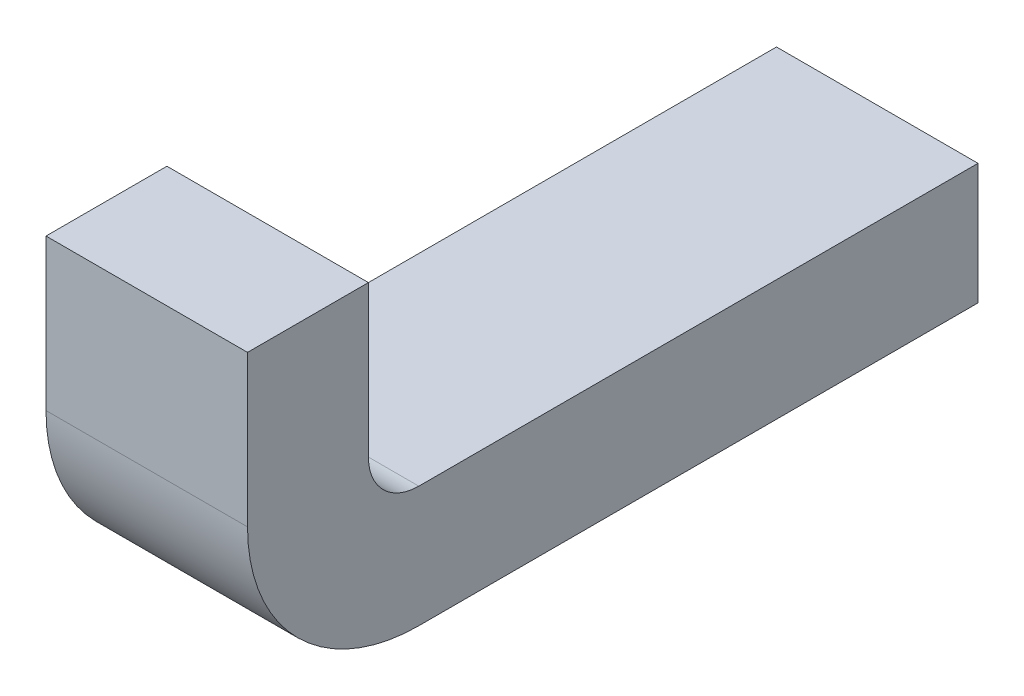
ISO-10303-21;
HEADER;
FILE_DESCRIPTION(('STEP AP214'),'2;1');
FILE_NAME('part.step','',(''),(''),'','','');
FILE_SCHEMA(('AUTOMOTIVE_DESIGN { 1 0 10303 214 1 1 1 1 }'));
ENDSEC;
DATA;
#1=APPLICATION_CONTEXT('core data for automotive mechanical design processes');
#2=APPLICATION_PROTOCOL_DEFINITION('international standard','automotive_design',2000,#1);
#3=PRODUCT_CONTEXT('',#1,'mechanical');
#4=PRODUCT('Part','Part','',(#3));
#5=PRODUCT_RELATED_PRODUCT_CATEGORY('part','',(#4));
#6=PRODUCT_DEFINITION_FORMATION('','',#4);
#7=PRODUCT_DEFINITION_CONTEXT('part definition',#1,'design');
#8=PRODUCT_DEFINITION('design','',#6,#7);
#9=PRODUCT_DEFINITION_SHAPE('','',#8);
#10=(LENGTH_UNIT() NAMED_UNIT(*) SI_UNIT(.MILLI.,.METRE.));
#11=(NAMED_UNIT(*) PLANE_ANGLE_UNIT() SI_UNIT($,.RADIAN.));
#12=(NAMED_UNIT(*) SI_UNIT($,.STERADIAN.) SOLID_ANGLE_UNIT());
#13=UNCERTAINTY_MEASURE_WITH_UNIT(LENGTH_MEASURE(1.E-05),#10,'distance_accuracy_value','');
#14=(GEOMETRIC_REPRESENTATION_CONTEXT(3) GLOBAL_UNCERTAINTY_ASSIGNED_CONTEXT((#13)) GLOBAL_UNIT_ASSIGNED_CONTEXT((#10,
#11,#12)) REPRESENTATION_CONTEXT('',''));
#15=CARTESIAN_POINT('',(0.,0.,0.));
#16=DIRECTION('',(0.,0.,1.));
#17=DIRECTION('',(1.,0.,0.));
#18=AXIS2_PLACEMENT_3D('',#15,#16,#17);
#19=CARTESIAN_POINT('',(-2.39,0.17,-3.250000000002));
#20=DIRECTION('',(0.,0.,-1.));
#21=DIRECTION('',(-1.,0.,0.));
#22=AXIS2_PLACEMENT_3D('',#19,#20,#21);
#23=PLANE('',#22);
#24=DIRECTION('',(0.,1.,0.));
#25=VECTOR('',#24,1.);
#26=CARTESIAN_POINT('',(-2.175,0.17,-3.250000000002));
#27=LINE('',#26,#25);
#28=CARTESIAN_POINT('',(-2.175,0.17,-3.250000000002));
#29=VERTEX_POINT('',#28);
#30=CARTESIAN_POINT('',(-2.175,0.32,-3.250000000002));
#31=VERTEX_POINT('',#30);
#32=EDGE_CURVE('E138',#29,#31,#27,.T.);
#33=ORIENTED_EDGE('',*,*,#32,.F.);
#34=DIRECTION('',(1.,0.,0.));
#35=VECTOR('',#34,1.);
#36=CARTESIAN_POINT('',(-2.39,0.17,-3.250000000002));
#37=LINE('',#36,#35);
#38=CARTESIAN_POINT('',(-2.375,0.17,-3.250000000002));
#39=VERTEX_POINT('',#38);
#40=EDGE_CURVE('E107',#29,#39,#37,.F.);
#41=ORIENTED_EDGE('',*,*,#40,.T.);
#42=DIRECTION('',(0.,1.,0.));
#43=VECTOR('',#42,1.);
#44=CARTESIAN_POINT('',(-2.375,0.32,-3.250000000002));
#45=LINE('',#44,#43);
#46=CARTESIAN_POINT('',(-2.375,0.32,-3.250000000002));
#47=VERTEX_POINT('',#46);
#48=EDGE_CURVE('E104',#39,#47,#45,.T.);
#49=ORIENTED_EDGE('',*,*,#48,.T.);
#50=DIRECTION('',(1.,0.,0.));
#51=VECTOR('',#50,1.);
#52=CARTESIAN_POINT('',(-2.39,0.32,-3.250000000002));
#53=LINE('',#52,#51);
#54=EDGE_CURVE('E131',#31,#47,#53,.F.);
#55=ORIENTED_EDGE('',*,*,#54,.F.);
#56=EDGE_LOOP('',(#33,#41,#49,#55));
#57=FACE_BOUND('',#56,.T.);
#58=ADVANCED_FACE('F16',(#57),#23,.T.);
#59=CARTESIAN_POINT('',(-2.39,0.32,-3.250000000002));
#60=DIRECTION('',(0.,1.,1.246832498358E-13));
#61=DIRECTION('',(0.,-1.246832498358E-13,1.));
#62=AXIS2_PLACEMENT_3D('',#59,#60,#61);
#63=PLANE('',#62);
#64=DIRECTION('',(0.,0.,-1.));
#65=VECTOR('',#64,1.);
#66=CARTESIAN_POINT('',(-2.175,0.32,-3.300000000002));
#67=LINE('',#66,#65);
#68=CARTESIAN_POINT('',(-2.175,0.32,-3.130000000002));
#69=VERTEX_POINT('',#68);
#70=EDGE_CURVE('E134',#31,#69,#67,.F.);
#71=ORIENTED_EDGE('',*,*,#70,.F.);
#72=ORIENTED_EDGE('',*,*,#54,.T.);
#73=DIRECTION('',(0.,0.,-1.));
#74=VECTOR('',#73,1.);
#75=CARTESIAN_POINT('',(-2.375,0.32,3.855));
#76=LINE('',#75,#74);
#77=CARTESIAN_POINT('',(-2.375,0.32,-3.130000000002));
#78=VERTEX_POINT('',#77);
#79=EDGE_CURVE('E98',#47,#78,#76,.F.);
#80=ORIENTED_EDGE('',*,*,#79,.T.);
#81=DIRECTION('',(1.,0.,0.));
#82=VECTOR('',#81,1.);
#83=CARTESIAN_POINT('',(-2.39,0.32,-3.130000000002));
#84=LINE('',#83,#82);
#85=EDGE_CURVE('E129',#69,#78,#84,.F.);
#86=ORIENTED_EDGE('',*,*,#85,.F.);
#87=EDGE_LOOP('',(#71,#72,#80,#86));
#88=FACE_BOUND('',#87,.T.);
#89=ADVANCED_FACE('F188',(#88),#63,.T.);
#90=CARTESIAN_POINT('',(-2.39,0.32,-3.130000000002));
#91=DIRECTION('',(0.,0.,1.));
#92=DIRECTION('',(1.,0.,0.));
#93=AXIS2_PLACEMENT_3D('',#90,#91,#92);
#94=PLANE('',#93);
#95=DIRECTION('',(0.,1.,0.));
#96=VECTOR('',#95,1.);
#97=CARTESIAN_POINT('',(-2.175,0.17,-3.130000000002));
#98=LINE('',#97,#96);
#99=CARTESIAN_POINT('',(-2.175,0.17,-3.130000000002));
#100=VERTEX_POINT('',#99);
#101=EDGE_CURVE('E137',#69,#100,#98,.F.);
#102=ORIENTED_EDGE('',*,*,#101,.F.);
#103=ORIENTED_EDGE('',*,*,#85,.T.);
#104=DIRECTION('',(0.,1.,0.));
#105=VECTOR('',#104,1.);
#106=CARTESIAN_POINT('',(-2.375,0.32,-3.130000000002));
#107=LINE('',#106,#105);
#108=CARTESIAN_POINT('',(-2.375,0.17,-3.130000000002));
#109=VERTEX_POINT('',#108);
#110=EDGE_CURVE('E78',#78,#109,#107,.F.);
#111=ORIENTED_EDGE('',*,*,#110,.T.);
#112=DIRECTION('',(1.,0.,0.));
#113=VECTOR('',#112,1.);
#114=CARTESIAN_POINT('',(-2.39,0.17,-3.130000000002));
#115=LINE('',#114,#113);
#116=EDGE_CURVE('E88',#100,#109,#115,.F.);
#117=ORIENTED_EDGE('',*,*,#116,.F.);
#118=EDGE_LOOP('',(#102,#103,#111,#117));
#119=FACE_BOUND('',#118,.T.);
#120=ADVANCED_FACE('F190',(#119),#94,.T.);
#121=CARTESIAN_POINT('',(-2.39,0.17,-3.300000000002));
#122=DIRECTION('',(1.,0.,0.));
#123=DIRECTION('',(0.,0.,-1.));
#124=AXIS2_PLACEMENT_3D('',#121,#122,#123);
#125=CYLINDRICAL_SURFACE('',#124,0.17);
#126=CARTESIAN_POINT('',(-2.175,0.17,-3.300000000002));
#127=DIRECTION('',(1.,0.,0.));
#128=DIRECTION('',(0.,0.,-1.));
#129=AXIS2_PLACEMENT_3D('',#126,#127,#128);
#130=CIRCLE('',#129,0.17);
#131=CARTESIAN_POINT('',(-2.175,0.,-3.300000000002));
#132=VERTEX_POINT('',#131);
#133=EDGE_CURVE('E149',#100,#132,#130,.T.);
#134=ORIENTED_EDGE('',*,*,#133,.F.);
#135=ORIENTED_EDGE('',*,*,#116,.T.);
#136=CARTESIAN_POINT('',(-2.375,0.17,-3.300000000002));
#137=DIRECTION('',(1.,0.,0.));
#138=DIRECTION('',(0.,0.,-1.));
#139=AXIS2_PLACEMENT_3D('',#136,#137,#138);
#140=CIRCLE('',#139,0.17);
#141=CARTESIAN_POINT('',(-2.375,0.,-3.300000000002));
#142=VERTEX_POINT('',#141);
#143=EDGE_CURVE('E19',#109,#142,#140,.T.);
#144=ORIENTED_EDGE('',*,*,#143,.T.);
#145=DIRECTION('',(1.,0.,0.));
#146=VECTOR('',#145,1.);
#147=CARTESIAN_POINT('',(-2.39,0.,-3.300000000002));
#148=LINE('',#147,#146);
#149=EDGE_CURVE('E86',#132,#142,#148,.F.);
#150=ORIENTED_EDGE('',*,*,#149,.F.);
#151=EDGE_LOOP('',(#134,#135,#144,#150));
#152=FACE_BOUND('',#151,.T.);
#153=ADVANCED_FACE('F85',(#152),#125,.T.);
#154=CARTESIAN_POINT('',(-2.39,0.,-3.300000000002));
#155=DIRECTION('',(0.,-1.,0.));
#156=DIRECTION('',(0.,0.,-1.));
#157=AXIS2_PLACEMENT_3D('',#154,#155,#156);
#158=PLANE('',#157);
#159=DIRECTION('',(0.,0.,-1.));
#160=VECTOR('',#159,1.);
#161=CARTESIAN_POINT('',(-2.175,0.,-3.300000000002));
#162=LINE('',#161,#160);
#163=CARTESIAN_POINT('',(-2.175,0.,-3.854999999999));
#164=VERTEX_POINT('',#163);
#165=EDGE_CURVE('E96',#132,#164,#162,.T.);
#166=ORIENTED_EDGE('',*,*,#165,.F.);
#167=ORIENTED_EDGE('',*,*,#149,.T.);
#168=DIRECTION('',(0.,0.,-1.));
#169=VECTOR('',#168,1.);
#170=CARTESIAN_POINT('',(-2.375,0.,3.855));
#171=LINE('',#170,#169);
#172=CARTESIAN_POINT('',(-2.375,0.,-3.854999999999));
#173=VERTEX_POINT('',#172);
#174=EDGE_CURVE('E91',#142,#173,#171,.T.);
#175=ORIENTED_EDGE('',*,*,#174,.T.);
#176=DIRECTION('',(-1.,0.,0.));
#177=VECTOR('',#176,1.);
#178=CARTESIAN_POINT('',(-2.39,0.,-3.854999999999));
#179=LINE('',#178,#177);
#180=EDGE_CURVE('E121',#164,#173,#179,.T.);
#181=ORIENTED_EDGE('',*,*,#180,.F.);
#182=EDGE_LOOP('',(#166,#167,#175,#181));
#183=FACE_BOUND('',#182,.T.);
#184=ADVANCED_FACE('F93',(#183),#158,.T.);
#185=CARTESIAN_POINT('',(-2.375,0.32,3.855));
#186=DIRECTION('',(1.,0.,0.));
#187=DIRECTION('',(0.,0.,-1.));
#188=AXIS2_PLACEMENT_3D('',#185,#186,#187);
#189=PLANE('',#188);
#190=CARTESIAN_POINT('',(-2.375,0.17,-3.300000000002));
#191=DIRECTION('',(1.,0.,0.));
#192=DIRECTION('',(0.,0.,-1.));
#193=AXIS2_PLACEMENT_3D('',#190,#191,#192);
#194=CIRCLE('',#193,0.05);
#195=CARTESIAN_POINT('',(-2.375,0.12,-3.300000000002));
#196=VERTEX_POINT('',#195);
#197=EDGE_CURVE('E126',#39,#196,#194,.T.);
#198=ORIENTED_EDGE('',*,*,#197,.T.);
#199=DIRECTION('',(0.,0.,1.));
#200=VECTOR('',#199,1.);
#201=CARTESIAN_POINT('',(-2.375,0.12,-3.854999999999));
#202=LINE('',#201,#200);
#203=CARTESIAN_POINT('',(-2.375,0.12,-3.854999999999));
#204=VERTEX_POINT('',#203);
#205=EDGE_CURVE('E123',#204,#196,#202,.T.);
#206=ORIENTED_EDGE('',*,*,#205,.F.);
#207=DIRECTION('',(0.,1.,0.));
#208=VECTOR('',#207,1.);
#209=CARTESIAN_POINT('',(-2.375,0.,-3.854999999999));
#210=LINE('',#209,#208);
#211=EDGE_CURVE('E102',#173,#204,#210,.T.);
#212=ORIENTED_EDGE('',*,*,#211,.F.);
#213=ORIENTED_EDGE('',*,*,#174,.F.);
#214=ORIENTED_EDGE('',*,*,#143,.F.);
#215=ORIENTED_EDGE('',*,*,#110,.F.);
#216=ORIENTED_EDGE('',*,*,#79,.F.);
#217=ORIENTED_EDGE('',*,*,#48,.F.);
#218=EDGE_LOOP('',(#198,#206,#212,#213,#214,#215,#216,#217));
#219=FACE_BOUND('',#218,.T.);
#220=ADVANCED_FACE('F100',(#219),#189,.F.);
#221=CARTESIAN_POINT('',(-2.39,0.17,-3.300000000002));
#222=DIRECTION('',(1.,0.,0.));
#223=DIRECTION('',(0.,0.,-1.));
#224=AXIS2_PLACEMENT_3D('',#221,#222,#223);
#225=CYLINDRICAL_SURFACE('',#224,0.05);
#226=ORIENTED_EDGE('',*,*,#40,.F.);
#227=CARTESIAN_POINT('',(-2.175,0.17,-3.300000000002));
#228=DIRECTION('',(1.,0.,0.));
#229=DIRECTION('',(0.,0.,-1.));
#230=AXIS2_PLACEMENT_3D('',#227,#228,#229);
#231=CIRCLE('',#230,0.05);
#232=CARTESIAN_POINT('',(-2.175,0.12,-3.300000000002));
#233=VERTEX_POINT('',#232);
#234=EDGE_CURVE('E118',#233,#29,#231,.F.);
#235=ORIENTED_EDGE('',*,*,#234,.F.);
#236=DIRECTION('',(1.,0.,0.));
#237=VECTOR('',#236,1.);
#238=CARTESIAN_POINT('',(-2.39,0.12,-3.300000000002));
#239=LINE('',#238,#237);
#240=EDGE_CURVE('E161',#196,#233,#239,.T.);
#241=ORIENTED_EDGE('',*,*,#240,.F.);
#242=ORIENTED_EDGE('',*,*,#197,.F.);
#243=EDGE_LOOP('',(#226,#235,#241,#242));
#244=FACE_BOUND('',#243,.T.);
#245=ADVANCED_FACE('F183',(#244),#225,.F.);
#246=CARTESIAN_POINT('',(-2.175,0.17,-3.300000000002));
#247=DIRECTION('',(1.,0.,0.));
#248=DIRECTION('',(0.,0.,-1.));
#249=AXIS2_PLACEMENT_3D('',#246,#247,#248);
#250=PLANE('',#249);
#251=DIRECTION('',(0.,0.,1.));
#252=VECTOR('',#251,1.);
#253=CARTESIAN_POINT('',(-2.175,0.12,-3.854999999999));
#254=LINE('',#253,#252);
#255=CARTESIAN_POINT('',(-2.175,0.12,-3.854999999999));
#256=VERTEX_POINT('',#255);
#257=EDGE_CURVE('E25',#233,#256,#254,.F.);
#258=ORIENTED_EDGE('',*,*,#257,.F.);
#259=ORIENTED_EDGE('',*,*,#234,.T.);
#260=ORIENTED_EDGE('',*,*,#32,.T.);
#261=ORIENTED_EDGE('',*,*,#70,.T.);
#262=ORIENTED_EDGE('',*,*,#101,.T.);
#263=ORIENTED_EDGE('',*,*,#133,.T.);
#264=ORIENTED_EDGE('',*,*,#165,.T.);
#265=DIRECTION('',(0.,1.,0.));
#266=VECTOR('',#265,1.);
#267=CARTESIAN_POINT('',(-2.175,0.,-3.854999999999));
#268=LINE('',#267,#266);
#269=EDGE_CURVE('E34',#256,#164,#268,.F.);
#270=ORIENTED_EDGE('',*,*,#269,.F.);
#271=EDGE_LOOP('',(#258,#259,#260,#261,#262,#263,#264,#270));
#272=FACE_BOUND('',#271,.T.);
#273=ADVANCED_FACE('F180',(#272),#250,.T.);
#274=CARTESIAN_POINT('',(-2.39,0.,-3.854999999999));
#275=DIRECTION('',(0.,0.,-1.));
#276=DIRECTION('',(-1.,0.,0.));
#277=AXIS2_PLACEMENT_3D('',#274,#275,#276);
#278=PLANE('',#277);
#279=ORIENTED_EDGE('',*,*,#269,.T.);
#280=ORIENTED_EDGE('',*,*,#180,.T.);
#281=ORIENTED_EDGE('',*,*,#211,.T.);
#282=DIRECTION('',(1.,0.,0.));
#283=VECTOR('',#282,1.);
#284=CARTESIAN_POINT('',(-2.39,0.12,-3.854999999999));
#285=LINE('',#284,#283);
#286=EDGE_CURVE('E11',#256,#204,#285,.F.);
#287=ORIENTED_EDGE('',*,*,#286,.F.);
#288=EDGE_LOOP('',(#279,#280,#281,#287));
#289=FACE_BOUND('',#288,.T.);
#290=ADVANCED_FACE('F179',(#289),#278,.T.);
#291=CARTESIAN_POINT('',(-2.39,0.12,-3.854999999999));
#292=DIRECTION('',(0.,1.,0.));
#293=DIRECTION('',(0.,0.,1.));
#294=AXIS2_PLACEMENT_3D('',#291,#292,#293);
#295=PLANE('',#294);
#296=ORIENTED_EDGE('',*,*,#257,.T.);
#297=ORIENTED_EDGE('',*,*,#286,.T.);
#298=ORIENTED_EDGE('',*,*,#205,.T.);
#299=ORIENTED_EDGE('',*,*,#240,.T.);
#300=EDGE_LOOP('',(#296,#297,#298,#299));
#301=FACE_BOUND('',#300,.T.);
#302=ADVANCED_FACE('F177',(#301),#295,.T.);
#303=CLOSED_SHELL('',(#58,#89,#120,#153,#184,#220,#245,#273,#290,#302));
#304=MANIFOLD_SOLID_BREP('B1',#303);
#305=ADVANCED_BREP_SHAPE_REPRESENTATION('',(#18,#304),#14);
#306=SHAPE_DEFINITION_REPRESENTATION(#9,#305);
ENDSEC;
END-ISO-10303-21;
